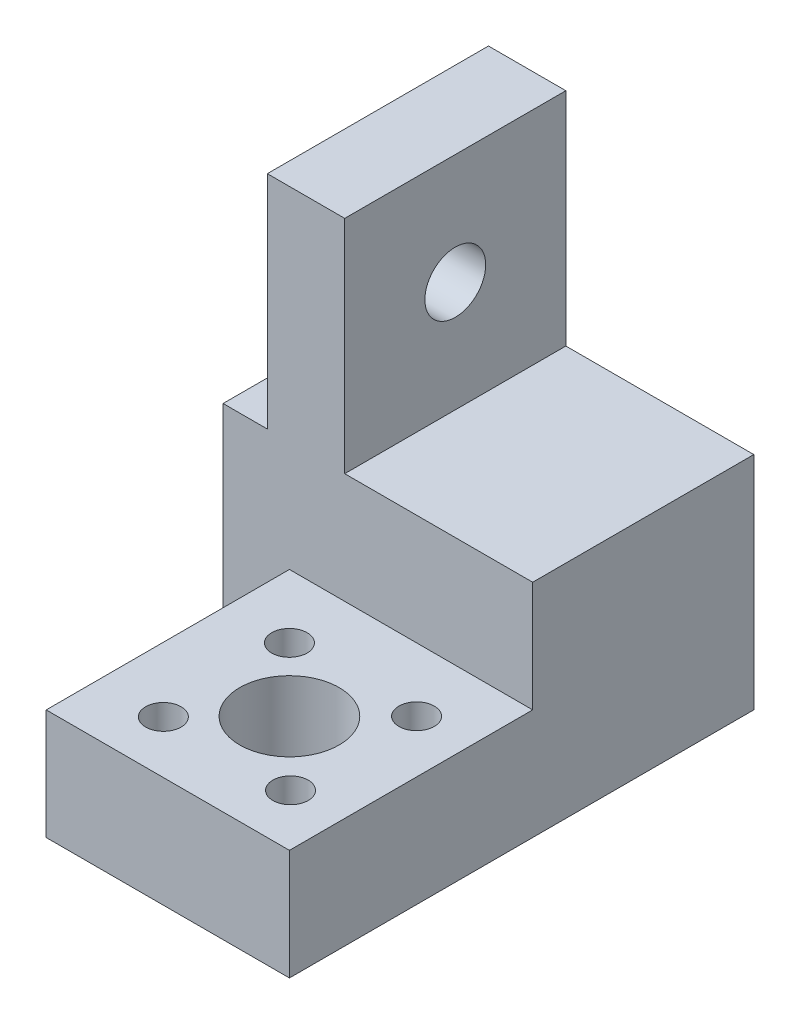
ISO-10303-21;
HEADER;
FILE_DESCRIPTION(('STEP AP214'),'2;1');
FILE_NAME('part.step','',(''),(''),'','','');
FILE_SCHEMA(('AUTOMOTIVE_DESIGN { 1 0 10303 214 1 1 1 1 }'));
ENDSEC;
DATA;
#1=APPLICATION_CONTEXT('core data for automotive mechanical design processes');
#2=APPLICATION_PROTOCOL_DEFINITION('international standard','automotive_design',2000,#1);
#3=PRODUCT_CONTEXT('',#1,'mechanical');
#4=PRODUCT('Part','Part','',(#3));
#5=PRODUCT_RELATED_PRODUCT_CATEGORY('part','',(#4));
#6=PRODUCT_DEFINITION_FORMATION('','',#4);
#7=PRODUCT_DEFINITION_CONTEXT('part definition',#1,'design');
#8=PRODUCT_DEFINITION('design','',#6,#7);
#9=PRODUCT_DEFINITION_SHAPE('','',#8);
#10=(LENGTH_UNIT() NAMED_UNIT(*) SI_UNIT(.MILLI.,.METRE.));
#11=(NAMED_UNIT(*) PLANE_ANGLE_UNIT() SI_UNIT($,.RADIAN.));
#12=(NAMED_UNIT(*) SI_UNIT($,.STERADIAN.) SOLID_ANGLE_UNIT());
#13=UNCERTAINTY_MEASURE_WITH_UNIT(LENGTH_MEASURE(1.E-05),#10,'distance_accuracy_value','');
#14=(GEOMETRIC_REPRESENTATION_CONTEXT(3) GLOBAL_UNCERTAINTY_ASSIGNED_CONTEXT((#13)) GLOBAL_UNIT_ASSIGNED_CONTEXT((#10,
#11,#12)) REPRESENTATION_CONTEXT('',''));
#15=CARTESIAN_POINT('',(0.,0.,0.));
#16=DIRECTION('',(0.,0.,1.));
#17=DIRECTION('',(1.,0.,0.));
#18=AXIS2_PLACEMENT_3D('',#15,#16,#17);
#19=CARTESIAN_POINT('',(11.,20.,-31.));
#20=DIRECTION('',(0.,-1.,0.));
#21=DIRECTION('',(0.,0.,-1.));
#22=AXIS2_PLACEMENT_3D('',#19,#20,#21);
#23=PLANE('',#22);
#24=DIRECTION('',(0.,0.,1.));
#25=VECTOR('',#24,1.);
#26=CARTESIAN_POINT('',(-13.,20.,-11.));
#27=LINE('',#26,#25);
#28=CARTESIAN_POINT('',(-13.,20.,-31.));
#29=VERTEX_POINT('',#28);
#30=CARTESIAN_POINT('',(-13.,20.,-11.));
#31=VERTEX_POINT('',#30);
#32=EDGE_CURVE('E50',#29,#31,#27,.T.);
#33=ORIENTED_EDGE('',*,*,#32,.F.);
#34=DIRECTION('',(1.,0.,0.));
#35=VECTOR('',#34,1.);
#36=CARTESIAN_POINT('',(11.,20.,-31.));
#37=LINE('',#36,#35);
#38=CARTESIAN_POINT('',(-17.,20.,-31.));
#39=VERTEX_POINT('',#38);
#40=EDGE_CURVE('E159',#39,#29,#37,.T.);
#41=ORIENTED_EDGE('',*,*,#40,.F.);
#42=DIRECTION('',(0.,0.,1.));
#43=VECTOR('',#42,1.);
#44=CARTESIAN_POINT('',(-17.,20.,-31.));
#45=LINE('',#44,#43);
#46=CARTESIAN_POINT('',(-17.,20.,-11.));
#47=VERTEX_POINT('',#46);
#48=EDGE_CURVE('E169',#39,#47,#45,.T.);
#49=ORIENTED_EDGE('',*,*,#48,.T.);
#50=DIRECTION('',(1.,0.,0.));
#51=VECTOR('',#50,1.);
#52=CARTESIAN_POINT('',(11.,20.,-11.));
#53=LINE('',#52,#51);
#54=EDGE_CURVE('E154',#47,#31,#53,.T.);
#55=ORIENTED_EDGE('',*,*,#54,.T.);
#56=EDGE_LOOP('',(#33,#41,#49,#55));
#57=FACE_BOUND('',#56,.T.);
#58=ADVANCED_FACE('F35',(#57),#23,.F.);
#59=DIRECTION('',(0.,0.,-1.));
#60=VECTOR('',#59,1.);
#61=CARTESIAN_POINT('',(-6.,20.,-11.));
#62=LINE('',#61,#60);
#63=CARTESIAN_POINT('',(-6.,20.,-11.));
#64=VERTEX_POINT('',#63);
#65=CARTESIAN_POINT('',(-6.,20.,-31.));
#66=VERTEX_POINT('',#65);
#67=EDGE_CURVE('E58',#64,#66,#62,.T.);
#68=ORIENTED_EDGE('',*,*,#67,.F.);
#69=CARTESIAN_POINT('',(11.,20.,-11.));
#70=VERTEX_POINT('',#69);
#71=EDGE_CURVE('E165',#64,#70,#53,.T.);
#72=ORIENTED_EDGE('',*,*,#71,.T.);
#73=DIRECTION('',(0.,0.,1.));
#74=VECTOR('',#73,1.);
#75=CARTESIAN_POINT('',(11.,20.,-31.));
#76=LINE('',#75,#74);
#77=CARTESIAN_POINT('',(11.,20.,-31.));
#78=VERTEX_POINT('',#77);
#79=EDGE_CURVE('E160',#78,#70,#76,.T.);
#80=ORIENTED_EDGE('',*,*,#79,.F.);
#81=EDGE_CURVE('E158',#66,#78,#37,.T.);
#82=ORIENTED_EDGE('',*,*,#81,.F.);
#83=EDGE_LOOP('',(#68,#72,#80,#82));
#84=FACE_BOUND('',#83,.T.);
#85=ADVANCED_FACE('F254',(#84),#23,.F.);
#86=CARTESIAN_POINT('',(0.,10.,0.));
#87=DIRECTION('',(0.,1.,0.));
#88=DIRECTION('',(0.,0.,1.));
#89=AXIS2_PLACEMENT_3D('',#86,#87,#88);
#90=PLANE('',#89);
#91=CARTESIAN_POINT('',(0.5,10.,0.5));
#92=DIRECTION('',(0.,1.,0.));
#93=DIRECTION('',(0.,0.,1.));
#94=AXIS2_PLACEMENT_3D('',#91,#92,#93);
#95=CIRCLE('',#94,4.5);
#96=CARTESIAN_POINT('',(0.5,10.,5.));
#97=VERTEX_POINT('',#96);
#98=EDGE_CURVE('E293',#97,#97,#95,.T.);
#99=ORIENTED_EDGE('',*,*,#98,.F.);
#100=EDGE_LOOP('',(#99));
#101=FACE_BOUND('',#100,.T.);
#102=CARTESIAN_POINT('',(6.3486183830419,10.,6.25));
#103=DIRECTION('',(0.,1.,0.));
#104=DIRECTION('',(0.,0.,1.));
#105=AXIS2_PLACEMENT_3D('',#102,#103,#104);
#106=CIRCLE('',#105,1.6);
#107=CARTESIAN_POINT('',(6.3486183830419,10.,7.85));
#108=VERTEX_POINT('',#107);
#109=EDGE_CURVE('E182',#108,#108,#106,.T.);
#110=ORIENTED_EDGE('',*,*,#109,.F.);
#111=EDGE_LOOP('',(#110));
#112=FACE_BOUND('',#111,.T.);
#113=CARTESIAN_POINT('',(-5.25,10.,-5.25));
#114=DIRECTION('',(0.,1.,0.));
#115=DIRECTION('',(0.,0.,1.));
#116=AXIS2_PLACEMENT_3D('',#113,#114,#115);
#117=CIRCLE('',#116,1.6);
#118=CARTESIAN_POINT('',(-5.25,10.,-3.65));
#119=VERTEX_POINT('',#118);
#120=EDGE_CURVE('E194',#119,#119,#117,.T.);
#121=ORIENTED_EDGE('',*,*,#120,.F.);
#122=EDGE_LOOP('',(#121));
#123=FACE_BOUND('',#122,.T.);
#124=DIRECTION('',(0.,0.,1.));
#125=VECTOR('',#124,1.);
#126=CARTESIAN_POINT('',(-11.,10.,-11.));
#127=LINE('',#126,#125);
#128=CARTESIAN_POINT('',(-11.,10.,-11.));
#129=VERTEX_POINT('',#128);
#130=CARTESIAN_POINT('',(-11.,10.,11.));
#131=VERTEX_POINT('',#130);
#132=EDGE_CURVE('E200',#129,#131,#127,.T.);
#133=ORIENTED_EDGE('',*,*,#132,.T.);
#134=DIRECTION('',(1.,0.,0.));
#135=VECTOR('',#134,1.);
#136=CARTESIAN_POINT('',(-11.,10.,11.));
#137=LINE('',#136,#135);
#138=CARTESIAN_POINT('',(11.,10.,11.));
#139=VERTEX_POINT('',#138);
#140=EDGE_CURVE('E203',#131,#139,#137,.T.);
#141=ORIENTED_EDGE('',*,*,#140,.T.);
#142=DIRECTION('',(0.,0.,-1.));
#143=VECTOR('',#142,1.);
#144=CARTESIAN_POINT('',(11.,10.,-11.));
#145=LINE('',#144,#143);
#146=CARTESIAN_POINT('',(11.,10.,-11.));
#147=VERTEX_POINT('',#146);
#148=EDGE_CURVE('E206',#139,#147,#145,.T.);
#149=ORIENTED_EDGE('',*,*,#148,.T.);
#150=DIRECTION('',(-1.,0.,0.));
#151=VECTOR('',#150,1.);
#152=CARTESIAN_POINT('',(-11.,10.,-11.));
#153=LINE('',#152,#151);
#154=EDGE_CURVE('E209',#147,#129,#153,.T.);
#155=ORIENTED_EDGE('',*,*,#154,.T.);
#156=EDGE_LOOP('',(#133,#141,#149,#155));
#157=FACE_BOUND('',#156,.T.);
#158=CARTESIAN_POINT('',(6.25,10.,-5.25));
#159=DIRECTION('',(0.,1.,0.));
#160=DIRECTION('',(0.,0.,1.));
#161=AXIS2_PLACEMENT_3D('',#158,#159,#160);
#162=CIRCLE('',#161,1.6);
#163=CARTESIAN_POINT('',(6.25,10.,-3.65));
#164=VERTEX_POINT('',#163);
#165=EDGE_CURVE('E188',#164,#164,#162,.T.);
#166=ORIENTED_EDGE('',*,*,#165,.F.);
#167=EDGE_LOOP('',(#166));
#168=FACE_BOUND('',#167,.T.);
#169=CARTESIAN_POINT('',(-5.1513816169581,10.,6.25));
#170=DIRECTION('',(0.,1.,0.));
#171=DIRECTION('',(0.,0.,1.));
#172=AXIS2_PLACEMENT_3D('',#169,#170,#171);
#173=CIRCLE('',#172,1.6);
#174=CARTESIAN_POINT('',(-5.1513816169581,10.,7.85));
#175=VERTEX_POINT('',#174);
#176=EDGE_CURVE('E176',#175,#175,#173,.T.);
#177=ORIENTED_EDGE('',*,*,#176,.F.);
#178=EDGE_LOOP('',(#177));
#179=FACE_BOUND('',#178,.T.);
#180=ADVANCED_FACE('F241',(#101,#112,#123,#157,#168,#179),#90,.T.);
#181=CARTESIAN_POINT('',(0.,0.,0.));
#182=DIRECTION('',(0.,1.,0.));
#183=DIRECTION('',(0.,0.,1.));
#184=AXIS2_PLACEMENT_3D('',#181,#182,#183);
#185=PLANE('',#184);
#186=CARTESIAN_POINT('',(0.5,0.,0.5));
#187=DIRECTION('',(0.,1.,0.));
#188=DIRECTION('',(0.,0.,1.));
#189=AXIS2_PLACEMENT_3D('',#186,#187,#188);
#190=CIRCLE('',#189,4.5);
#191=CARTESIAN_POINT('',(0.5,0.,5.));
#192=VERTEX_POINT('',#191);
#193=EDGE_CURVE('E290',#192,#192,#190,.T.);
#194=ORIENTED_EDGE('',*,*,#193,.T.);
#195=EDGE_LOOP('',(#194));
#196=FACE_BOUND('',#195,.T.);
#197=DIRECTION('',(0.,0.,1.));
#198=VECTOR('',#197,1.);
#199=CARTESIAN_POINT('',(-11.,0.,-11.));
#200=LINE('',#199,#198);
#201=CARTESIAN_POINT('',(-11.,0.,-11.));
#202=VERTEX_POINT('',#201);
#203=CARTESIAN_POINT('',(-11.,0.,11.));
#204=VERTEX_POINT('',#203);
#205=EDGE_CURVE('E197',#202,#204,#200,.T.);
#206=ORIENTED_EDGE('',*,*,#205,.F.);
#207=DIRECTION('',(-1.,0.,0.));
#208=VECTOR('',#207,1.);
#209=CARTESIAN_POINT('',(11.,0.,-11.));
#210=LINE('',#209,#208);
#211=CARTESIAN_POINT('',(-17.,0.,-11.));
#212=VERTEX_POINT('',#211);
#213=EDGE_CURVE('E144',#202,#212,#210,.T.);
#214=ORIENTED_EDGE('',*,*,#213,.T.);
#215=DIRECTION('',(0.,0.,1.));
#216=VECTOR('',#215,1.);
#217=CARTESIAN_POINT('',(-17.,0.,-31.));
#218=LINE('',#217,#216);
#219=CARTESIAN_POINT('',(-17.,0.,-31.));
#220=VERTEX_POINT('',#219);
#221=EDGE_CURVE('E172',#220,#212,#218,.T.);
#222=ORIENTED_EDGE('',*,*,#221,.F.);
#223=DIRECTION('',(-1.,0.,0.));
#224=VECTOR('',#223,1.);
#225=CARTESIAN_POINT('',(11.,0.,-31.));
#226=LINE('',#225,#224);
#227=CARTESIAN_POINT('',(11.,0.,-31.));
#228=VERTEX_POINT('',#227);
#229=EDGE_CURVE('E153',#228,#220,#226,.T.);
#230=ORIENTED_EDGE('',*,*,#229,.F.);
#231=DIRECTION('',(0.,0.,-1.));
#232=VECTOR('',#231,1.);
#233=CARTESIAN_POINT('',(11.,0.,-11.));
#234=LINE('',#233,#232);
#235=CARTESIAN_POINT('',(11.,0.,11.));
#236=VERTEX_POINT('',#235);
#237=EDGE_CURVE('E204',#236,#228,#234,.T.);
#238=ORIENTED_EDGE('',*,*,#237,.F.);
#239=DIRECTION('',(1.,0.,0.));
#240=VECTOR('',#239,1.);
#241=CARTESIAN_POINT('',(-11.,0.,11.));
#242=LINE('',#241,#240);
#243=EDGE_CURVE('E215',#204,#236,#242,.T.);
#244=ORIENTED_EDGE('',*,*,#243,.F.);
#245=EDGE_LOOP('',(#206,#214,#222,#230,#238,#244));
#246=FACE_BOUND('',#245,.T.);
#247=CARTESIAN_POINT('',(-5.25,0.,-5.25));
#248=DIRECTION('',(0.,1.,0.));
#249=DIRECTION('',(0.,0.,1.));
#250=AXIS2_PLACEMENT_3D('',#247,#248,#249);
#251=CIRCLE('',#250,1.6);
#252=CARTESIAN_POINT('',(-5.25,0.,-3.65));
#253=VERTEX_POINT('',#252);
#254=EDGE_CURVE('E191',#253,#253,#251,.T.);
#255=ORIENTED_EDGE('',*,*,#254,.T.);
#256=EDGE_LOOP('',(#255));
#257=FACE_BOUND('',#256,.T.);
#258=CARTESIAN_POINT('',(6.25,0.,-5.25));
#259=DIRECTION('',(0.,1.,0.));
#260=DIRECTION('',(0.,0.,1.));
#261=AXIS2_PLACEMENT_3D('',#258,#259,#260);
#262=CIRCLE('',#261,1.6);
#263=CARTESIAN_POINT('',(6.25,0.,-3.65));
#264=VERTEX_POINT('',#263);
#265=EDGE_CURVE('E185',#264,#264,#262,.T.);
#266=ORIENTED_EDGE('',*,*,#265,.T.);
#267=EDGE_LOOP('',(#266));
#268=FACE_BOUND('',#267,.T.);
#269=CARTESIAN_POINT('',(6.3486183830419,0.,6.25));
#270=DIRECTION('',(0.,1.,0.));
#271=DIRECTION('',(0.,0.,1.));
#272=AXIS2_PLACEMENT_3D('',#269,#270,#271);
#273=CIRCLE('',#272,1.6);
#274=CARTESIAN_POINT('',(6.3486183830419,0.,7.85));
#275=VERTEX_POINT('',#274);
#276=EDGE_CURVE('E179',#275,#275,#273,.T.);
#277=ORIENTED_EDGE('',*,*,#276,.T.);
#278=EDGE_LOOP('',(#277));
#279=FACE_BOUND('',#278,.T.);
#280=CARTESIAN_POINT('',(-5.1513816169581,0.,6.25));
#281=DIRECTION('',(0.,1.,0.));
#282=DIRECTION('',(0.,0.,1.));
#283=AXIS2_PLACEMENT_3D('',#280,#281,#282);
#284=CIRCLE('',#283,1.6);
#285=CARTESIAN_POINT('',(-5.1513816169581,0.,7.85));
#286=VERTEX_POINT('',#285);
#287=EDGE_CURVE('E175',#286,#286,#284,.T.);
#288=ORIENTED_EDGE('',*,*,#287,.T.);
#289=EDGE_LOOP('',(#288));
#290=FACE_BOUND('',#289,.T.);
#291=ADVANCED_FACE('F230',(#196,#246,#257,#268,#279,#290),#185,.F.);
#292=CARTESIAN_POINT('',(-11.,10.,-11.));
#293=DIRECTION('',(1.,0.,0.));
#294=DIRECTION('',(0.,0.,-1.));
#295=AXIS2_PLACEMENT_3D('',#292,#293,#294);
#296=PLANE('',#295);
#297=ORIENTED_EDGE('',*,*,#205,.T.);
#298=DIRECTION('',(0.,-1.,0.));
#299=VECTOR('',#298,1.);
#300=CARTESIAN_POINT('',(-11.,10.,11.));
#301=LINE('',#300,#299);
#302=EDGE_CURVE('E11',#131,#204,#301,.T.);
#303=ORIENTED_EDGE('',*,*,#302,.F.);
#304=ORIENTED_EDGE('',*,*,#132,.F.);
#305=DIRECTION('',(0.,-1.,0.));
#306=VECTOR('',#305,1.);
#307=CARTESIAN_POINT('',(-11.,10.,-11.));
#308=LINE('',#307,#306);
#309=EDGE_CURVE('E212',#129,#202,#308,.T.);
#310=ORIENTED_EDGE('',*,*,#309,.T.);
#311=EDGE_LOOP('',(#297,#303,#304,#310));
#312=FACE_BOUND('',#311,.T.);
#313=ADVANCED_FACE('F37',(#312),#296,.F.);
#314=CARTESIAN_POINT('',(-11.,10.,11.));
#315=DIRECTION('',(0.,0.,-1.));
#316=DIRECTION('',(-1.,0.,0.));
#317=AXIS2_PLACEMENT_3D('',#314,#315,#316);
#318=PLANE('',#317);
#319=ORIENTED_EDGE('',*,*,#243,.T.);
#320=DIRECTION('',(0.,-1.,0.));
#321=VECTOR('',#320,1.);
#322=CARTESIAN_POINT('',(11.,10.,11.));
#323=LINE('',#322,#321);
#324=EDGE_CURVE('E43',#139,#236,#323,.T.);
#325=ORIENTED_EDGE('',*,*,#324,.F.);
#326=ORIENTED_EDGE('',*,*,#140,.F.);
#327=ORIENTED_EDGE('',*,*,#302,.T.);
#328=EDGE_LOOP('',(#319,#325,#326,#327));
#329=FACE_BOUND('',#328,.T.);
#330=ADVANCED_FACE('F245',(#329),#318,.F.);
#331=CARTESIAN_POINT('',(11.,10.,-11.));
#332=DIRECTION('',(-1.,0.,0.));
#333=DIRECTION('',(0.,0.,1.));
#334=AXIS2_PLACEMENT_3D('',#331,#332,#333);
#335=PLANE('',#334);
#336=ORIENTED_EDGE('',*,*,#237,.T.);
#337=DIRECTION('',(0.,-1.,0.));
#338=VECTOR('',#337,1.);
#339=CARTESIAN_POINT('',(11.,0.,-31.));
#340=LINE('',#339,#338);
#341=EDGE_CURVE('E150',#78,#228,#340,.T.);
#342=ORIENTED_EDGE('',*,*,#341,.F.);
#343=ORIENTED_EDGE('',*,*,#79,.T.);
#344=DIRECTION('',(0.,-1.,0.));
#345=VECTOR('',#344,1.);
#346=CARTESIAN_POINT('',(11.,0.,-11.));
#347=LINE('',#346,#345);
#348=EDGE_CURVE('E141',#70,#147,#347,.T.);
#349=ORIENTED_EDGE('',*,*,#348,.T.);
#350=ORIENTED_EDGE('',*,*,#148,.F.);
#351=ORIENTED_EDGE('',*,*,#324,.T.);
#352=EDGE_LOOP('',(#336,#342,#343,#349,#350,#351));
#353=FACE_BOUND('',#352,.T.);
#354=ADVANCED_FACE('F224',(#353),#335,.F.);
#355=CARTESIAN_POINT('',(-5.25,10.,-5.25));
#356=DIRECTION('',(0.,-1.,0.));
#357=DIRECTION('',(0.,0.,-1.));
#358=AXIS2_PLACEMENT_3D('',#355,#356,#357);
#359=CYLINDRICAL_SURFACE('',#358,1.6);
#360=ORIENTED_EDGE('',*,*,#120,.T.);
#361=EDGE_LOOP('',(#360));
#362=FACE_BOUND('',#361,.T.);
#363=ORIENTED_EDGE('',*,*,#254,.F.);
#364=EDGE_LOOP('',(#363));
#365=FACE_BOUND('',#364,.T.);
#366=ADVANCED_FACE('F251',(#362,#365),#359,.F.);
#367=CARTESIAN_POINT('',(6.25,10.,-5.25));
#368=DIRECTION('',(0.,-1.,0.));
#369=DIRECTION('',(0.,0.,-1.));
#370=AXIS2_PLACEMENT_3D('',#367,#368,#369);
#371=CYLINDRICAL_SURFACE('',#370,1.6);
#372=ORIENTED_EDGE('',*,*,#165,.T.);
#373=EDGE_LOOP('',(#372));
#374=FACE_BOUND('',#373,.T.);
#375=ORIENTED_EDGE('',*,*,#265,.F.);
#376=EDGE_LOOP('',(#375));
#377=FACE_BOUND('',#376,.T.);
#378=ADVANCED_FACE('F273',(#374,#377),#371,.F.);
#379=CARTESIAN_POINT('',(6.3486183830419,10.,6.25));
#380=DIRECTION('',(0.,-1.,0.));
#381=DIRECTION('',(0.,0.,-1.));
#382=AXIS2_PLACEMENT_3D('',#379,#380,#381);
#383=CYLINDRICAL_SURFACE('',#382,1.6);
#384=ORIENTED_EDGE('',*,*,#109,.T.);
#385=EDGE_LOOP('',(#384));
#386=FACE_BOUND('',#385,.T.);
#387=ORIENTED_EDGE('',*,*,#276,.F.);
#388=EDGE_LOOP('',(#387));
#389=FACE_BOUND('',#388,.T.);
#390=ADVANCED_FACE('F269',(#386,#389),#383,.F.);
#391=CARTESIAN_POINT('',(-5.1513816169581,10.,6.25));
#392=DIRECTION('',(0.,-1.,0.));
#393=DIRECTION('',(0.,0.,-1.));
#394=AXIS2_PLACEMENT_3D('',#391,#392,#393);
#395=CYLINDRICAL_SURFACE('',#394,1.6);
#396=ORIENTED_EDGE('',*,*,#176,.T.);
#397=EDGE_LOOP('',(#396));
#398=FACE_BOUND('',#397,.T.);
#399=ORIENTED_EDGE('',*,*,#287,.F.);
#400=EDGE_LOOP('',(#399));
#401=FACE_BOUND('',#400,.T.);
#402=ADVANCED_FACE('F266',(#398,#401),#395,.F.);
#403=CARTESIAN_POINT('',(0.,0.,-11.));
#404=DIRECTION('',(0.,0.,1.));
#405=DIRECTION('',(1.,0.,0.));
#406=AXIS2_PLACEMENT_3D('',#403,#404,#405);
#407=PLANE('',#406);
#408=ORIENTED_EDGE('',*,*,#309,.F.);
#409=ORIENTED_EDGE('',*,*,#154,.F.);
#410=ORIENTED_EDGE('',*,*,#348,.F.);
#411=ORIENTED_EDGE('',*,*,#71,.F.);
#412=DIRECTION('',(0.,-1.,0.));
#413=VECTOR('',#412,1.);
#414=CARTESIAN_POINT('',(-6.,40.,-11.));
#415=LINE('',#414,#413);
#416=CARTESIAN_POINT('',(-6.,40.,-11.));
#417=VERTEX_POINT('',#416);
#418=EDGE_CURVE('E126',#417,#64,#415,.T.);
#419=ORIENTED_EDGE('',*,*,#418,.F.);
#420=DIRECTION('',(1.,0.,0.));
#421=VECTOR('',#420,1.);
#422=CARTESIAN_POINT('',(-13.,40.,-11.));
#423=LINE('',#422,#421);
#424=CARTESIAN_POINT('',(-13.,40.,-11.));
#425=VERTEX_POINT('',#424);
#426=EDGE_CURVE('E119',#425,#417,#423,.T.);
#427=ORIENTED_EDGE('',*,*,#426,.F.);
#428=DIRECTION('',(0.,-1.,0.));
#429=VECTOR('',#428,1.);
#430=CARTESIAN_POINT('',(-13.,40.,-11.));
#431=LINE('',#430,#429);
#432=EDGE_CURVE('E124',#425,#31,#431,.T.);
#433=ORIENTED_EDGE('',*,*,#432,.T.);
#434=ORIENTED_EDGE('',*,*,#54,.F.);
#435=DIRECTION('',(0.,1.,0.));
#436=VECTOR('',#435,1.);
#437=CARTESIAN_POINT('',(-17.,0.,-11.));
#438=LINE('',#437,#436);
#439=EDGE_CURVE('E163',#212,#47,#438,.T.);
#440=ORIENTED_EDGE('',*,*,#439,.F.);
#441=ORIENTED_EDGE('',*,*,#213,.F.);
#442=EDGE_LOOP('',(#408,#409,#410,#411,#419,#427,#433,#434,#440,#441));
#443=FACE_BOUND('',#442,.T.);
#444=ADVANCED_FACE('F121',(#443),#407,.T.);
#445=CARTESIAN_POINT('',(-17.,0.,-31.));
#446=DIRECTION('',(1.,0.,0.));
#447=DIRECTION('',(0.,0.,-1.));
#448=AXIS2_PLACEMENT_3D('',#445,#446,#447);
#449=PLANE('',#448);
#450=ORIENTED_EDGE('',*,*,#439,.T.);
#451=ORIENTED_EDGE('',*,*,#48,.F.);
#452=DIRECTION('',(0.,1.,0.));
#453=VECTOR('',#452,1.);
#454=CARTESIAN_POINT('',(-17.,0.,-31.));
#455=LINE('',#454,#453);
#456=EDGE_CURVE('E156',#220,#39,#455,.T.);
#457=ORIENTED_EDGE('',*,*,#456,.F.);
#458=ORIENTED_EDGE('',*,*,#221,.T.);
#459=EDGE_LOOP('',(#450,#451,#457,#458));
#460=FACE_BOUND('',#459,.T.);
#461=ADVANCED_FACE('F262',(#460),#449,.F.);
#462=CARTESIAN_POINT('',(0.,0.,-31.));
#463=DIRECTION('',(0.,0.,1.));
#464=DIRECTION('',(1.,0.,0.));
#465=AXIS2_PLACEMENT_3D('',#462,#463,#464);
#466=PLANE('',#465);
#467=ORIENTED_EDGE('',*,*,#341,.T.);
#468=ORIENTED_EDGE('',*,*,#229,.T.);
#469=ORIENTED_EDGE('',*,*,#456,.T.);
#470=ORIENTED_EDGE('',*,*,#40,.T.);
#471=DIRECTION('',(0.,-1.,0.));
#472=VECTOR('',#471,1.);
#473=CARTESIAN_POINT('',(-13.,40.,-31.));
#474=LINE('',#473,#472);
#475=CARTESIAN_POINT('',(-13.,40.,-31.));
#476=VERTEX_POINT('',#475);
#477=EDGE_CURVE('E305',#476,#29,#474,.T.);
#478=ORIENTED_EDGE('',*,*,#477,.F.);
#479=DIRECTION('',(-1.,0.,0.));
#480=VECTOR('',#479,1.);
#481=CARTESIAN_POINT('',(-13.,40.,-31.));
#482=LINE('',#481,#480);
#483=CARTESIAN_POINT('',(-6.,40.,-31.));
#484=VERTEX_POINT('',#483);
#485=EDGE_CURVE('E135',#484,#476,#482,.T.);
#486=ORIENTED_EDGE('',*,*,#485,.F.);
#487=DIRECTION('',(0.,-1.,0.));
#488=VECTOR('',#487,1.);
#489=CARTESIAN_POINT('',(-6.,40.,-31.));
#490=LINE('',#489,#488);
#491=EDGE_CURVE('E146',#484,#66,#490,.T.);
#492=ORIENTED_EDGE('',*,*,#491,.T.);
#493=ORIENTED_EDGE('',*,*,#81,.T.);
#494=EDGE_LOOP('',(#467,#468,#469,#470,#478,#486,#492,#493));
#495=FACE_BOUND('',#494,.T.);
#496=ADVANCED_FACE('F235',(#495),#466,.F.);
#497=CARTESIAN_POINT('',(-13.,40.,-11.));
#498=DIRECTION('',(1.,0.,0.));
#499=DIRECTION('',(0.,0.,-1.));
#500=AXIS2_PLACEMENT_3D('',#497,#498,#499);
#501=PLANE('',#500);
#502=CARTESIAN_POINT('',(-13.,30.,-21.));
#503=DIRECTION('',(1.,0.,0.));
#504=DIRECTION('',(0.,0.,-1.));
#505=AXIS2_PLACEMENT_3D('',#502,#503,#504);
#506=CIRCLE('',#505,2.75);
#507=CARTESIAN_POINT('',(-13.,30.,-23.75));
#508=VERTEX_POINT('',#507);
#509=EDGE_CURVE('E296',#508,#508,#506,.T.);
#510=ORIENTED_EDGE('',*,*,#509,.T.);
#511=EDGE_LOOP('',(#510));
#512=FACE_BOUND('',#511,.T.);
#513=ORIENTED_EDGE('',*,*,#32,.T.);
#514=ORIENTED_EDGE('',*,*,#432,.F.);
#515=DIRECTION('',(0.,0.,1.));
#516=VECTOR('',#515,1.);
#517=CARTESIAN_POINT('',(-13.,40.,-11.));
#518=LINE('',#517,#516);
#519=EDGE_CURVE('E130',#476,#425,#518,.T.);
#520=ORIENTED_EDGE('',*,*,#519,.F.);
#521=ORIENTED_EDGE('',*,*,#477,.T.);
#522=EDGE_LOOP('',(#513,#514,#520,#521));
#523=FACE_BOUND('',#522,.T.);
#524=ADVANCED_FACE('F140',(#512,#523),#501,.F.);
#525=CARTESIAN_POINT('',(-6.,40.,-11.));
#526=DIRECTION('',(-1.,0.,0.));
#527=DIRECTION('',(0.,0.,1.));
#528=AXIS2_PLACEMENT_3D('',#525,#526,#527);
#529=PLANE('',#528);
#530=CARTESIAN_POINT('',(-6.,30.,-21.));
#531=DIRECTION('',(1.,0.,0.));
#532=DIRECTION('',(0.,0.,-1.));
#533=AXIS2_PLACEMENT_3D('',#530,#531,#532);
#534=CIRCLE('',#533,2.75);
#535=CARTESIAN_POINT('',(-6.,30.,-23.75));
#536=VERTEX_POINT('',#535);
#537=EDGE_CURVE('E292',#536,#536,#534,.T.);
#538=ORIENTED_EDGE('',*,*,#537,.F.);
#539=EDGE_LOOP('',(#538));
#540=FACE_BOUND('',#539,.T.);
#541=ORIENTED_EDGE('',*,*,#67,.T.);
#542=ORIENTED_EDGE('',*,*,#491,.F.);
#543=DIRECTION('',(0.,0.,-1.));
#544=VECTOR('',#543,1.);
#545=CARTESIAN_POINT('',(-6.,40.,-11.));
#546=LINE('',#545,#544);
#547=EDGE_CURVE('E129',#417,#484,#546,.T.);
#548=ORIENTED_EDGE('',*,*,#547,.F.);
#549=ORIENTED_EDGE('',*,*,#418,.T.);
#550=EDGE_LOOP('',(#541,#542,#548,#549));
#551=FACE_BOUND('',#550,.T.);
#552=ADVANCED_FACE('F310',(#540,#551),#529,.F.);
#553=CARTESIAN_POINT('',(0.,40.,0.));
#554=DIRECTION('',(0.,-1.,0.));
#555=DIRECTION('',(0.,0.,-1.));
#556=AXIS2_PLACEMENT_3D('',#553,#554,#555);
#557=PLANE('',#556);
#558=ORIENTED_EDGE('',*,*,#519,.T.);
#559=ORIENTED_EDGE('',*,*,#426,.T.);
#560=ORIENTED_EDGE('',*,*,#547,.T.);
#561=ORIENTED_EDGE('',*,*,#485,.T.);
#562=EDGE_LOOP('',(#558,#559,#560,#561));
#563=FACE_BOUND('',#562,.T.);
#564=ADVANCED_FACE('F133',(#563),#557,.F.);
#565=CARTESIAN_POINT('',(-17.,30.,-21.));
#566=DIRECTION('',(1.,0.,0.));
#567=DIRECTION('',(0.,0.,-1.));
#568=AXIS2_PLACEMENT_3D('',#565,#566,#567);
#569=CYLINDRICAL_SURFACE('',#568,2.75);
#570=ORIENTED_EDGE('',*,*,#537,.T.);
#571=EDGE_LOOP('',(#570));
#572=FACE_BOUND('',#571,.T.);
#573=ORIENTED_EDGE('',*,*,#509,.F.);
#574=EDGE_LOOP('',(#573));
#575=FACE_BOUND('',#574,.T.);
#576=ADVANCED_FACE('F318',(#572,#575),#569,.F.);
#577=CARTESIAN_POINT('',(0.5,0.,0.5));
#578=DIRECTION('',(0.,1.,0.));
#579=DIRECTION('',(0.,0.,1.));
#580=AXIS2_PLACEMENT_3D('',#577,#578,#579);
#581=CYLINDRICAL_SURFACE('',#580,4.5);
#582=ORIENTED_EDGE('',*,*,#193,.F.);
#583=EDGE_LOOP('',(#582));
#584=FACE_BOUND('',#583,.T.);
#585=ORIENTED_EDGE('',*,*,#98,.T.);
#586=EDGE_LOOP('',(#585));
#587=FACE_BOUND('',#586,.T.);
#588=ADVANCED_FACE('F351',(#584,#587),#581,.F.);
#589=CLOSED_SHELL('',(#58,#85,#180,#291,#313,#330,#354,#366,#378,#390,#402,#444,#461,#496,#524,
#552,#564,#576,#588));
#590=MANIFOLD_SOLID_BREP('B2',#589);
#591=ADVANCED_BREP_SHAPE_REPRESENTATION('',(#18,#590),#14);
#592=SHAPE_DEFINITION_REPRESENTATION(#9,#591);
ENDSEC;
END-ISO-10303-21;
